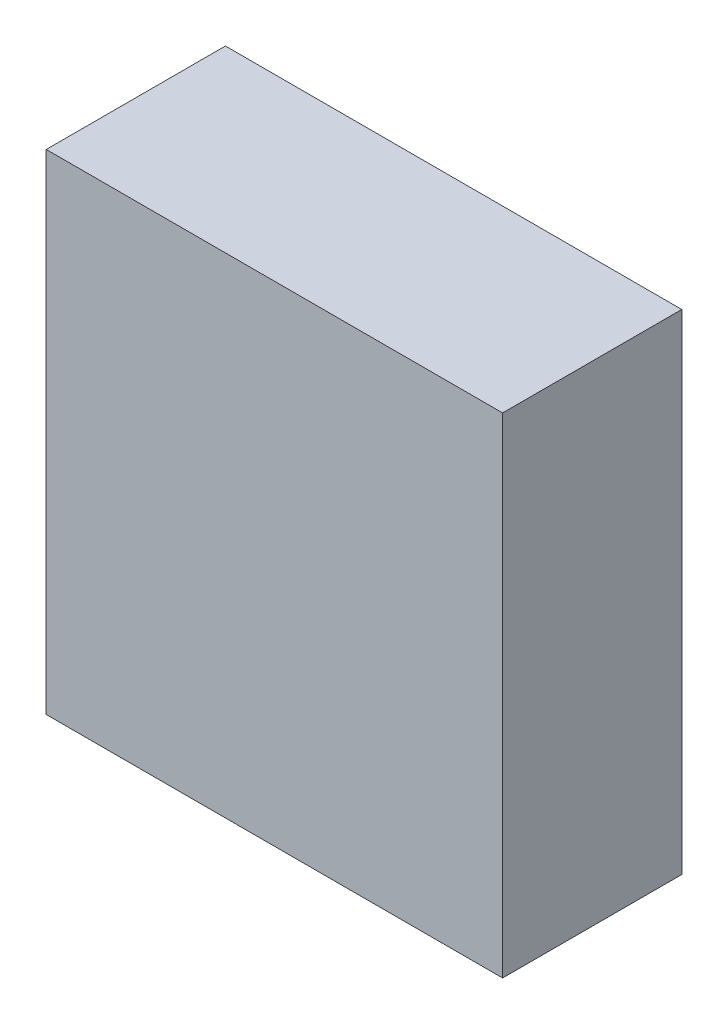
ISO-10303-21;
HEADER;
FILE_DESCRIPTION(('STEP AP214'),'2;1');
FILE_NAME('part.step','',(''),(''),'','','');
FILE_SCHEMA(('AUTOMOTIVE_DESIGN { 1 0 10303 214 1 1 1 1 }'));
ENDSEC;
DATA;
#1=APPLICATION_CONTEXT('core data for automotive mechanical design processes');
#2=APPLICATION_PROTOCOL_DEFINITION('international standard','automotive_design',2000,#1);
#3=PRODUCT_CONTEXT('',#1,'mechanical');
#4=PRODUCT('Part','Part','',(#3));
#5=PRODUCT_RELATED_PRODUCT_CATEGORY('part','',(#4));
#6=PRODUCT_DEFINITION_FORMATION('','',#4);
#7=PRODUCT_DEFINITION_CONTEXT('part definition',#1,'design');
#8=PRODUCT_DEFINITION('design','',#6,#7);
#9=PRODUCT_DEFINITION_SHAPE('','',#8);
#10=(LENGTH_UNIT() NAMED_UNIT(*) SI_UNIT(.MILLI.,.METRE.));
#11=(NAMED_UNIT(*) PLANE_ANGLE_UNIT() SI_UNIT($,.RADIAN.));
#12=(NAMED_UNIT(*) SI_UNIT($,.STERADIAN.) SOLID_ANGLE_UNIT());
#13=UNCERTAINTY_MEASURE_WITH_UNIT(LENGTH_MEASURE(1.E-05),#10,'distance_accuracy_value','');
#14=(GEOMETRIC_REPRESENTATION_CONTEXT(3) GLOBAL_UNCERTAINTY_ASSIGNED_CONTEXT((#13)) GLOBAL_UNIT_ASSIGNED_CONTEXT((#10,
#11,#12)) REPRESENTATION_CONTEXT('',''));
#15=CARTESIAN_POINT('',(0.,0.,0.));
#16=DIRECTION('',(0.,0.,1.));
#17=DIRECTION('',(1.,0.,0.));
#18=AXIS2_PLACEMENT_3D('',#15,#16,#17);
#19=CARTESIAN_POINT('',(0.,0.,32.));
#20=DIRECTION('',(0.,1.,0.));
#21=DIRECTION('',(0.,0.,1.));
#22=AXIS2_PLACEMENT_3D('',#19,#20,#21);
#23=PLANE('',#22);
#24=DIRECTION('',(1.,0.,0.));
#25=VECTOR('',#24,1.);
#26=CARTESIAN_POINT('',(0.,0.,0.));
#27=LINE('',#26,#25);
#28=CARTESIAN_POINT('',(-81.5,0.,0.));
#29=VERTEX_POINT('',#28);
#30=CARTESIAN_POINT('',(0.,0.,0.));
#31=VERTEX_POINT('',#30);
#32=EDGE_CURVE('E106',#29,#31,#27,.T.);
#33=ORIENTED_EDGE('',*,*,#32,.T.);
#34=DIRECTION('',(0.,0.,-1.));
#35=VECTOR('',#34,1.);
#36=CARTESIAN_POINT('',(0.,0.,32.));
#37=LINE('',#36,#35);
#38=CARTESIAN_POINT('',(0.,0.,32.));
#39=VERTEX_POINT('',#38);
#40=EDGE_CURVE('E11',#39,#31,#37,.T.);
#41=ORIENTED_EDGE('',*,*,#40,.F.);
#42=DIRECTION('',(1.,0.,0.));
#43=VECTOR('',#42,1.);
#44=CARTESIAN_POINT('',(0.,0.,32.));
#45=LINE('',#44,#43);
#46=CARTESIAN_POINT('',(-81.5,0.,32.));
#47=VERTEX_POINT('',#46);
#48=EDGE_CURVE('E94',#47,#39,#45,.T.);
#49=ORIENTED_EDGE('',*,*,#48,.F.);
#50=DIRECTION('',(0.,0.,-1.));
#51=VECTOR('',#50,1.);
#52=CARTESIAN_POINT('',(-81.5,0.,32.));
#53=LINE('',#52,#51);
#54=EDGE_CURVE('E102',#47,#29,#53,.T.);
#55=ORIENTED_EDGE('',*,*,#54,.T.);
#56=EDGE_LOOP('',(#33,#41,#49,#55));
#57=FACE_BOUND('',#56,.T.);
#58=ADVANCED_FACE('F43',(#57),#23,.F.);
#59=CARTESIAN_POINT('',(0.,0.,32.));
#60=DIRECTION('',(-1.,0.,0.));
#61=DIRECTION('',(0.,0.,1.));
#62=AXIS2_PLACEMENT_3D('',#59,#60,#61);
#63=PLANE('',#62);
#64=DIRECTION('',(0.,1.,0.));
#65=VECTOR('',#64,1.);
#66=CARTESIAN_POINT('',(0.,0.,0.));
#67=LINE('',#66,#65);
#68=CARTESIAN_POINT('',(0.,87.4,0.));
#69=VERTEX_POINT('',#68);
#70=EDGE_CURVE('E98',#31,#69,#67,.T.);
#71=ORIENTED_EDGE('',*,*,#70,.T.);
#72=DIRECTION('',(0.,0.,-1.));
#73=VECTOR('',#72,1.);
#74=CARTESIAN_POINT('',(0.,87.4,32.));
#75=LINE('',#74,#73);
#76=CARTESIAN_POINT('',(0.,87.4,32.));
#77=VERTEX_POINT('',#76);
#78=EDGE_CURVE('E51',#77,#69,#75,.T.);
#79=ORIENTED_EDGE('',*,*,#78,.F.);
#80=DIRECTION('',(0.,1.,0.));
#81=VECTOR('',#80,1.);
#82=CARTESIAN_POINT('',(0.,0.,32.));
#83=LINE('',#82,#81);
#84=EDGE_CURVE('E89',#39,#77,#83,.T.);
#85=ORIENTED_EDGE('',*,*,#84,.F.);
#86=ORIENTED_EDGE('',*,*,#40,.T.);
#87=EDGE_LOOP('',(#71,#79,#85,#86));
#88=FACE_BOUND('',#87,.T.);
#89=ADVANCED_FACE('F97',(#88),#63,.F.);
#90=CARTESIAN_POINT('',(0.,87.4,32.));
#91=DIRECTION('',(0.,-1.,0.));
#92=DIRECTION('',(0.,0.,-1.));
#93=AXIS2_PLACEMENT_3D('',#90,#91,#92);
#94=PLANE('',#93);
#95=DIRECTION('',(-1.,0.,0.));
#96=VECTOR('',#95,1.);
#97=CARTESIAN_POINT('',(0.,87.4,0.));
#98=LINE('',#97,#96);
#99=CARTESIAN_POINT('',(-81.5,87.4,0.));
#100=VERTEX_POINT('',#99);
#101=EDGE_CURVE('E76',#69,#100,#98,.T.);
#102=ORIENTED_EDGE('',*,*,#101,.T.);
#103=DIRECTION('',(0.,0.,-1.));
#104=VECTOR('',#103,1.);
#105=CARTESIAN_POINT('',(-81.5,87.4,32.));
#106=LINE('',#105,#104);
#107=CARTESIAN_POINT('',(-81.5,87.4,32.));
#108=VERTEX_POINT('',#107);
#109=EDGE_CURVE('E99',#108,#100,#106,.T.);
#110=ORIENTED_EDGE('',*,*,#109,.F.);
#111=DIRECTION('',(-1.,0.,0.));
#112=VECTOR('',#111,1.);
#113=CARTESIAN_POINT('',(0.,87.4,32.));
#114=LINE('',#113,#112);
#115=EDGE_CURVE('E92',#77,#108,#114,.T.);
#116=ORIENTED_EDGE('',*,*,#115,.F.);
#117=ORIENTED_EDGE('',*,*,#78,.T.);
#118=EDGE_LOOP('',(#102,#110,#116,#117));
#119=FACE_BOUND('',#118,.T.);
#120=ADVANCED_FACE('F100',(#119),#94,.F.);
#121=CARTESIAN_POINT('',(-81.5,0.,32.));
#122=DIRECTION('',(1.,0.,0.));
#123=DIRECTION('',(0.,0.,-1.));
#124=AXIS2_PLACEMENT_3D('',#121,#122,#123);
#125=PLANE('',#124);
#126=DIRECTION('',(0.,-1.,0.));
#127=VECTOR('',#126,1.);
#128=CARTESIAN_POINT('',(-81.5,0.,0.));
#129=LINE('',#128,#127);
#130=EDGE_CURVE('E82',#100,#29,#129,.T.);
#131=ORIENTED_EDGE('',*,*,#130,.T.);
#132=ORIENTED_EDGE('',*,*,#54,.F.);
#133=DIRECTION('',(0.,-1.,0.));
#134=VECTOR('',#133,1.);
#135=CARTESIAN_POINT('',(-81.5,0.,32.));
#136=LINE('',#135,#134);
#137=EDGE_CURVE('E59',#108,#47,#136,.T.);
#138=ORIENTED_EDGE('',*,*,#137,.F.);
#139=ORIENTED_EDGE('',*,*,#109,.T.);
#140=EDGE_LOOP('',(#131,#132,#138,#139));
#141=FACE_BOUND('',#140,.T.);
#142=ADVANCED_FACE('F113',(#141),#125,.F.);
#143=CARTESIAN_POINT('',(0.,0.,32.));
#144=DIRECTION('',(0.,0.,-1.));
#145=DIRECTION('',(-1.,0.,0.));
#146=AXIS2_PLACEMENT_3D('',#143,#144,#145);
#147=PLANE('',#146);
#148=ORIENTED_EDGE('',*,*,#48,.T.);
#149=ORIENTED_EDGE('',*,*,#84,.T.);
#150=ORIENTED_EDGE('',*,*,#115,.T.);
#151=ORIENTED_EDGE('',*,*,#137,.T.);
#152=EDGE_LOOP('',(#148,#149,#150,#151));
#153=FACE_BOUND('',#152,.T.);
#154=ADVANCED_FACE('F90',(#153),#147,.F.);
#155=CARTESIAN_POINT('',(0.,0.,0.));
#156=DIRECTION('',(0.,0.,-1.));
#157=DIRECTION('',(-1.,0.,0.));
#158=AXIS2_PLACEMENT_3D('',#155,#156,#157);
#159=PLANE('',#158);
#160=ORIENTED_EDGE('',*,*,#32,.F.);
#161=ORIENTED_EDGE('',*,*,#130,.F.);
#162=ORIENTED_EDGE('',*,*,#101,.F.);
#163=ORIENTED_EDGE('',*,*,#70,.F.);
#164=EDGE_LOOP('',(#160,#161,#162,#163));
#165=FACE_BOUND('',#164,.T.);
#166=ADVANCED_FACE('F116',(#165),#159,.T.);
#167=CLOSED_SHELL('',(#58,#89,#120,#142,#154,#166));
#168=MANIFOLD_SOLID_BREP('B2',#167);
#169=ADVANCED_BREP_SHAPE_REPRESENTATION('',(#18,#168),#14);
#170=SHAPE_DEFINITION_REPRESENTATION(#9,#169);
ENDSEC;
END-ISO-10303-21;
